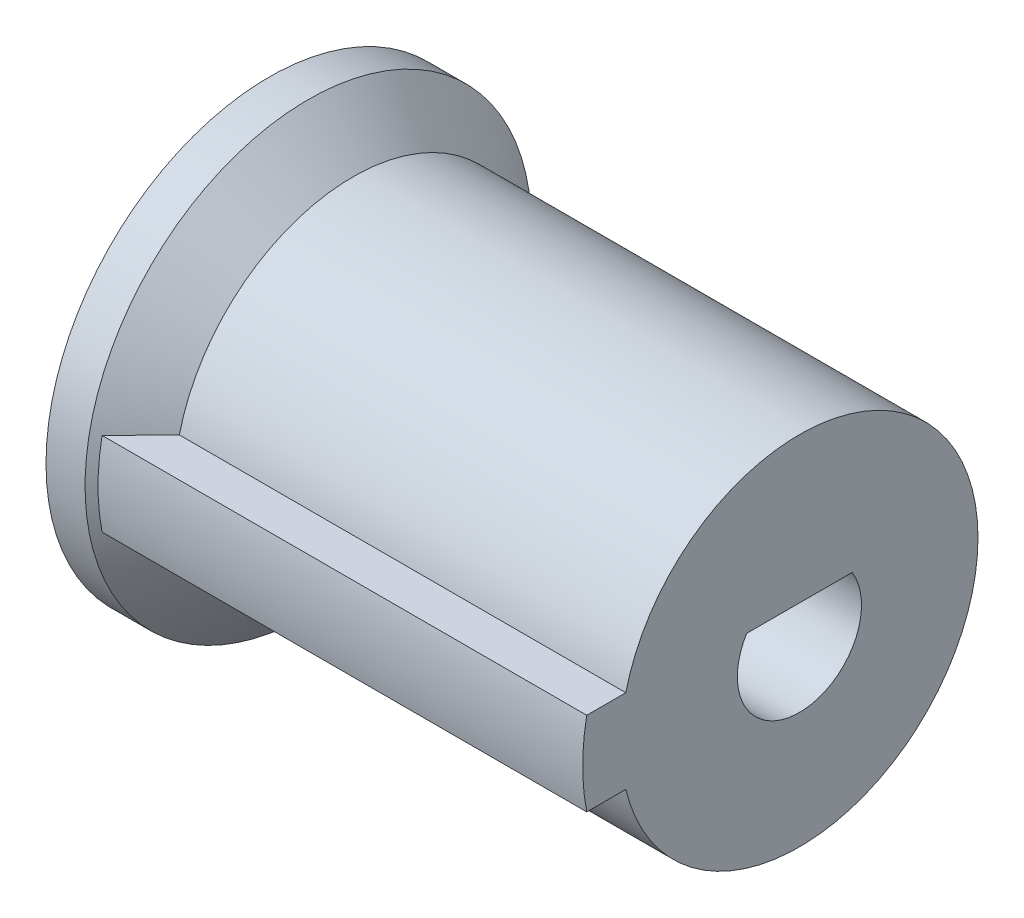
ISO-10303-21;
HEADER;
FILE_DESCRIPTION(('STEP AP214'),'2;1');
FILE_NAME('part.step','',(''),(''),'','','');
FILE_SCHEMA(('AUTOMOTIVE_DESIGN { 1 0 10303 214 1 1 1 1 }'));
ENDSEC;
DATA;
#1=APPLICATION_CONTEXT('core data for automotive mechanical design processes');
#2=APPLICATION_PROTOCOL_DEFINITION('international standard','automotive_design',2000,#1);
#3=PRODUCT_CONTEXT('',#1,'mechanical');
#4=PRODUCT('Part','Part','',(#3));
#5=PRODUCT_RELATED_PRODUCT_CATEGORY('part','',(#4));
#6=PRODUCT_DEFINITION_FORMATION('','',#4);
#7=PRODUCT_DEFINITION_CONTEXT('part definition',#1,'design');
#8=PRODUCT_DEFINITION('design','',#6,#7);
#9=PRODUCT_DEFINITION_SHAPE('','',#8);
#10=(LENGTH_UNIT() NAMED_UNIT(*) SI_UNIT(.MILLI.,.METRE.));
#11=(NAMED_UNIT(*) PLANE_ANGLE_UNIT() SI_UNIT($,.RADIAN.));
#12=(NAMED_UNIT(*) SI_UNIT($,.STERADIAN.) SOLID_ANGLE_UNIT());
#13=UNCERTAINTY_MEASURE_WITH_UNIT(LENGTH_MEASURE(1.E-05),#10,'distance_accuracy_value','');
#14=(GEOMETRIC_REPRESENTATION_CONTEXT(3) GLOBAL_UNCERTAINTY_ASSIGNED_CONTEXT((#13)) GLOBAL_UNIT_ASSIGNED_CONTEXT((#10,
#11,#12)) REPRESENTATION_CONTEXT('',''));
#15=CARTESIAN_POINT('',(0.,0.,0.));
#16=DIRECTION('',(0.,0.,1.));
#17=DIRECTION('',(1.,0.,0.));
#18=AXIS2_PLACEMENT_3D('',#15,#16,#17);
#19=CARTESIAN_POINT('',(16.,0.,0.));
#20=DIRECTION('',(-1.,0.,0.));
#21=DIRECTION('',(0.,0.,1.));
#22=AXIS2_PLACEMENT_3D('',#19,#20,#21);
#23=CYLINDRICAL_SURFACE('',#22,2.225);
#24=DIRECTION('',(-1.,0.,0.));
#25=VECTOR('',#24,1.);
#26=CARTESIAN_POINT('',(16.,1.175,-1.88944436276912));
#27=LINE('',#26,#25);
#28=CARTESIAN_POINT('',(16.,1.175,-1.88944436276912));
#29=VERTEX_POINT('',#28);
#30=CARTESIAN_POINT('',(-3.,1.175,-1.88944436276912));
#31=VERTEX_POINT('',#30);
#32=EDGE_CURVE('E106',#29,#31,#27,.T.);
#33=ORIENTED_EDGE('',*,*,#32,.T.);
#34=CARTESIAN_POINT('',(-3.,0.,0.));
#35=DIRECTION('',(1.,0.,0.));
#36=DIRECTION('',(0.,0.,-1.));
#37=AXIS2_PLACEMENT_3D('',#34,#35,#36);
#38=CIRCLE('',#37,2.225);
#39=CARTESIAN_POINT('',(-3.,1.175,1.88944436276912));
#40=VERTEX_POINT('',#39);
#41=EDGE_CURVE('E109',#40,#31,#38,.T.);
#42=ORIENTED_EDGE('',*,*,#41,.F.);
#43=DIRECTION('',(-1.,0.,0.));
#44=VECTOR('',#43,1.);
#45=CARTESIAN_POINT('',(16.,1.175,1.88944436276912));
#46=LINE('',#45,#44);
#47=CARTESIAN_POINT('',(16.,1.175,1.88944436276912));
#48=VERTEX_POINT('',#47);
#49=EDGE_CURVE('E95',#48,#40,#46,.T.);
#50=ORIENTED_EDGE('',*,*,#49,.F.);
#51=CARTESIAN_POINT('',(16.,0.,0.));
#52=DIRECTION('',(1.,0.,0.));
#53=DIRECTION('',(0.,0.,-1.));
#54=AXIS2_PLACEMENT_3D('',#51,#52,#53);
#55=CIRCLE('',#54,2.225);
#56=EDGE_CURVE('E129',#48,#29,#55,.T.);
#57=ORIENTED_EDGE('',*,*,#56,.T.);
#58=EDGE_LOOP('',(#33,#42,#50,#57));
#59=FACE_BOUND('',#58,.T.);
#60=ADVANCED_FACE('F36',(#59),#23,.F.);
#61=CARTESIAN_POINT('',(16.,1.5,0.));
#62=DIRECTION('',(0.,-1.,0.));
#63=DIRECTION('',(0.,0.,-1.));
#64=AXIS2_PLACEMENT_3D('',#61,#62,#63);
#65=PLANE('',#64);
#66=DIRECTION('',(-1.,0.,0.));
#67=VECTOR('',#66,1.);
#68=CARTESIAN_POINT('',(16.,1.5,6.22173609212091));
#69=LINE('',#68,#67);
#70=CARTESIAN_POINT('',(16.,1.5,6.22173609212091));
#71=VERTEX_POINT('',#70);
#72=CARTESIAN_POINT('',(0.,1.5,6.22173609212091));
#73=VERTEX_POINT('',#72);
#74=EDGE_CURVE('E131',#71,#73,#69,.T.);
#75=ORIENTED_EDGE('',*,*,#74,.T.);
#76=CARTESIAN_POINT('',(0.,1.5,6.22173609212088));
#77=CARTESIAN_POINT('',(-0.113699242355352,1.5,6.33869128195683));
#78=CARTESIAN_POINT('',(-0.227487223270543,1.5,6.45556013833574));
#79=CARTESIAN_POINT('',(-0.455217540474995,1.5,6.68914707584345));
#80=CARTESIAN_POINT('',(-0.569159876560946,1.5,6.80586515717044));
#81=CARTESIAN_POINT('',(-0.79717604183207,1.5,7.03917270311552));
#82=CARTESIAN_POINT('',(-0.911249870971236,1.5,7.15576216777858));
#83=CARTESIAN_POINT('',(-1.13951221595605,1.5,7.38882907992006));
#84=CARTESIAN_POINT('',(-1.25370073195215,1.5,7.50530652725115));
#85=CARTESIAN_POINT('',(-1.3679380184151,1.5,7.62173609212091));
#86=B_SPLINE_CURVE_WITH_KNOTS('',3,(#76,#77,#78,#79,#80,#81,#82,#83,#84,#85),.UNSPECIFIED.,.F.,
.F.,(4,2,2,2,4),(0.,0.489340572039448,0.978680500166129,1.46802025712641,1.95736065684443),.UNSPECIFIED.);
#87=CARTESIAN_POINT('',(-1.36793801841511,1.5,7.62173609212091));
#88=VERTEX_POINT('',#87);
#89=EDGE_CURVE('E143',#73,#88,#86,.T.);
#90=ORIENTED_EDGE('',*,*,#89,.T.);
#91=DIRECTION('',(-1.,0.,0.));
#92=VECTOR('',#91,1.);
#93=CARTESIAN_POINT('',(16.,1.5,7.62173609212091));
#94=LINE('',#93,#92);
#95=CARTESIAN_POINT('',(16.,1.5,7.62173609212091));
#96=VERTEX_POINT('',#95);
#97=EDGE_CURVE('E63',#96,#88,#94,.T.);
#98=ORIENTED_EDGE('',*,*,#97,.F.);
#99=DIRECTION('',(0.,0.,1.));
#100=VECTOR('',#99,1.);
#101=CARTESIAN_POINT('',(16.,1.5,0.));
#102=LINE('',#101,#100);
#103=EDGE_CURVE('E117',#71,#96,#102,.T.);
#104=ORIENTED_EDGE('',*,*,#103,.F.);
#105=EDGE_LOOP('',(#75,#90,#98,#104));
#106=FACE_BOUND('',#105,.T.);
#107=ADVANCED_FACE('F148',(#106),#65,.F.);
#108=CARTESIAN_POINT('',(16.,0.,0.));
#109=DIRECTION('',(-1.,0.,0.));
#110=DIRECTION('',(0.,0.,1.));
#111=AXIS2_PLACEMENT_3D('',#108,#109,#110);
#112=CYLINDRICAL_SURFACE('',#111,7.76793801841509);
#113=ORIENTED_EDGE('',*,*,#97,.T.);
#114=CARTESIAN_POINT('',(-1.3679380184151,0.,0.));
#115=DIRECTION('',(-1.,0.,0.));
#116=DIRECTION('',(0.,0.,1.));
#117=AXIS2_PLACEMENT_3D('',#114,#115,#116);
#118=CIRCLE('',#117,7.76793801841509);
#119=CARTESIAN_POINT('',(-1.36793801841511,-1.5,7.62173609212091));
#120=VERTEX_POINT('',#119);
#121=EDGE_CURVE('E50',#88,#120,#118,.F.);
#122=ORIENTED_EDGE('',*,*,#121,.T.);
#123=DIRECTION('',(-1.,0.,0.));
#124=VECTOR('',#123,1.);
#125=CARTESIAN_POINT('',(16.,-1.5,7.62173609212091));
#126=LINE('',#125,#124);
#127=CARTESIAN_POINT('',(16.,-1.5,7.62173609212091));
#128=VERTEX_POINT('',#127);
#129=EDGE_CURVE('E56',#128,#120,#126,.T.);
#130=ORIENTED_EDGE('',*,*,#129,.F.);
#131=CARTESIAN_POINT('',(16.,0.,0.));
#132=DIRECTION('',(1.,0.,0.));
#133=DIRECTION('',(0.,0.,-1.));
#134=AXIS2_PLACEMENT_3D('',#131,#132,#133);
#135=CIRCLE('',#134,7.76793801841509);
#136=EDGE_CURVE('E123',#96,#128,#135,.T.);
#137=ORIENTED_EDGE('',*,*,#136,.F.);
#138=EDGE_LOOP('',(#113,#122,#130,#137));
#139=FACE_BOUND('',#138,.T.);
#140=ADVANCED_FACE('F152',(#139),#112,.T.);
#141=CARTESIAN_POINT('',(16.,-1.5,0.));
#142=DIRECTION('',(0.,-1.,0.));
#143=DIRECTION('',(0.,0.,-1.));
#144=AXIS2_PLACEMENT_3D('',#141,#142,#143);
#145=PLANE('',#144);
#146=ORIENTED_EDGE('',*,*,#129,.T.);
#147=CARTESIAN_POINT('',(-1.3679380184151,-1.5,7.62173609212091));
#148=CARTESIAN_POINT('',(-1.25370073195215,-1.5,7.50530652725115));
#149=CARTESIAN_POINT('',(-1.13951221595605,-1.5,7.38882907992006));
#150=CARTESIAN_POINT('',(-0.911249870971236,-1.5,7.15576216777858));
#151=CARTESIAN_POINT('',(-0.797176041832071,-1.5,7.03917270311552));
#152=CARTESIAN_POINT('',(-0.569159876560947,-1.5,6.80586515717044));
#153=CARTESIAN_POINT('',(-0.455217540474996,-1.5,6.68914707584345));
#154=CARTESIAN_POINT('',(-0.227487223270544,-1.5,6.45556013833574));
#155=CARTESIAN_POINT('',(-0.113699242355352,-1.5,6.33869128195683));
#156=CARTESIAN_POINT('',(0.,-1.5,6.22173609212088));
#157=B_SPLINE_CURVE_WITH_KNOTS('',3,(#147,#148,#149,#150,#151,#152,#153,#154,#155,#156),
.UNSPECIFIED.,.F.,.F.,(4,2,2,2,4),(0.,0.489340399718017,0.978680156678296,1.46802008480498,
1.95736065684443),.UNSPECIFIED.);
#158=CARTESIAN_POINT('',(0.,-1.5,6.22173609212091));
#159=VERTEX_POINT('',#158);
#160=EDGE_CURVE('E11',#120,#159,#157,.T.);
#161=ORIENTED_EDGE('',*,*,#160,.T.);
#162=DIRECTION('',(-1.,0.,0.));
#163=VECTOR('',#162,1.);
#164=CARTESIAN_POINT('',(16.,-1.5,6.22173609212091));
#165=LINE('',#164,#163);
#166=CARTESIAN_POINT('',(16.,-1.5,6.22173609212091));
#167=VERTEX_POINT('',#166);
#168=EDGE_CURVE('E136',#167,#159,#165,.T.);
#169=ORIENTED_EDGE('',*,*,#168,.F.);
#170=DIRECTION('',(0.,0.,1.));
#171=VECTOR('',#170,1.);
#172=CARTESIAN_POINT('',(16.,-1.5,0.));
#173=LINE('',#172,#171);
#174=EDGE_CURVE('E125',#167,#128,#173,.T.);
#175=ORIENTED_EDGE('',*,*,#174,.T.);
#176=EDGE_LOOP('',(#146,#161,#169,#175));
#177=FACE_BOUND('',#176,.T.);
#178=ADVANCED_FACE('F155',(#177),#145,.T.);
#179=CARTESIAN_POINT('',(16.,0.,0.));
#180=DIRECTION('',(-1.,0.,0.));
#181=DIRECTION('',(0.,0.,1.));
#182=AXIS2_PLACEMENT_3D('',#179,#180,#181);
#183=CYLINDRICAL_SURFACE('',#182,6.4);
#184=CARTESIAN_POINT('',(0.,0.,0.));
#185=DIRECTION('',(1.,0.,0.));
#186=DIRECTION('',(0.,0.,-1.));
#187=AXIS2_PLACEMENT_3D('',#184,#185,#186);
#188=CIRCLE('',#187,6.4);
#189=EDGE_CURVE('E114',#159,#73,#188,.T.);
#190=ORIENTED_EDGE('',*,*,#189,.T.);
#191=ORIENTED_EDGE('',*,*,#74,.F.);
#192=CARTESIAN_POINT('',(16.,0.,0.));
#193=DIRECTION('',(1.,0.,0.));
#194=DIRECTION('',(0.,0.,-1.));
#195=AXIS2_PLACEMENT_3D('',#192,#193,#194);
#196=CIRCLE('',#195,6.4);
#197=EDGE_CURVE('E127',#167,#71,#196,.T.);
#198=ORIENTED_EDGE('',*,*,#197,.F.);
#199=ORIENTED_EDGE('',*,*,#168,.T.);
#200=EDGE_LOOP('',(#190,#191,#198,#199));
#201=FACE_BOUND('',#200,.T.);
#202=ADVANCED_FACE('F159',(#201),#183,.T.);
#203=CARTESIAN_POINT('',(16.,1.175,0.));
#204=DIRECTION('',(0.,1.,0.));
#205=DIRECTION('',(0.,0.,1.));
#206=AXIS2_PLACEMENT_3D('',#203,#204,#205);
#207=PLANE('',#206);
#208=ORIENTED_EDGE('',*,*,#49,.T.);
#209=DIRECTION('',(0.,0.,-1.));
#210=VECTOR('',#209,1.);
#211=CARTESIAN_POINT('',(-3.,1.175,0.));
#212=LINE('',#211,#210);
#213=EDGE_CURVE('E100',#40,#31,#212,.T.);
#214=ORIENTED_EDGE('',*,*,#213,.T.);
#215=ORIENTED_EDGE('',*,*,#32,.F.);
#216=DIRECTION('',(0.,0.,-1.));
#217=VECTOR('',#216,1.);
#218=CARTESIAN_POINT('',(16.,1.175,0.));
#219=LINE('',#218,#217);
#220=EDGE_CURVE('E101',#48,#29,#219,.T.);
#221=ORIENTED_EDGE('',*,*,#220,.F.);
#222=EDGE_LOOP('',(#208,#214,#215,#221));
#223=FACE_BOUND('',#222,.T.);
#224=ADVANCED_FACE('F97',(#223),#207,.F.);
#225=CARTESIAN_POINT('',(16.,0.,0.));
#226=DIRECTION('',(1.,0.,0.));
#227=DIRECTION('',(0.,0.,-1.));
#228=AXIS2_PLACEMENT_3D('',#225,#226,#227);
#229=PLANE('',#228);
#230=ORIENTED_EDGE('',*,*,#103,.T.);
#231=ORIENTED_EDGE('',*,*,#136,.T.);
#232=ORIENTED_EDGE('',*,*,#174,.F.);
#233=ORIENTED_EDGE('',*,*,#197,.T.);
#234=EDGE_LOOP('',(#230,#231,#232,#233));
#235=FACE_BOUND('',#234,.T.);
#236=ORIENTED_EDGE('',*,*,#56,.F.);
#237=ORIENTED_EDGE('',*,*,#220,.T.);
#238=EDGE_LOOP('',(#236,#237));
#239=FACE_BOUND('',#238,.T.);
#240=ADVANCED_FACE('F167',(#235,#239),#229,.T.);
#241=CARTESIAN_POINT('',(-3.,0.,0.));
#242=DIRECTION('',(1.,0.,0.));
#243=DIRECTION('',(0.,0.,-1.));
#244=AXIS2_PLACEMENT_3D('',#241,#242,#243);
#245=CYLINDRICAL_SURFACE('',#244,8.);
#246=CARTESIAN_POINT('',(-1.60000000000001,0.,0.));
#247=DIRECTION('',(1.,0.,0.));
#248=DIRECTION('',(0.,0.,-1.));
#249=AXIS2_PLACEMENT_3D('',#246,#247,#248);
#250=CIRCLE('',#249,8.);
#251=CARTESIAN_POINT('',(-1.60000000000001,0.,-8.));
#252=VERTEX_POINT('',#251);
#253=EDGE_CURVE('E105',#252,#252,#250,.F.);
#254=ORIENTED_EDGE('',*,*,#253,.T.);
#255=EDGE_LOOP('',(#254));
#256=FACE_BOUND('',#255,.T.);
#257=CARTESIAN_POINT('',(-3.,0.,0.));
#258=DIRECTION('',(1.,0.,0.));
#259=DIRECTION('',(0.,0.,-1.));
#260=AXIS2_PLACEMENT_3D('',#257,#258,#259);
#261=CIRCLE('',#260,8.);
#262=CARTESIAN_POINT('',(-3.,0.,-8.));
#263=VERTEX_POINT('',#262);
#264=EDGE_CURVE('E111',#263,#263,#261,.T.);
#265=ORIENTED_EDGE('',*,*,#264,.T.);
#266=EDGE_LOOP('',(#265));
#267=FACE_BOUND('',#266,.T.);
#268=ADVANCED_FACE('F170',(#256,#267),#245,.T.);
#269=CARTESIAN_POINT('',(-3.,0.,0.));
#270=DIRECTION('',(1.,0.,0.));
#271=DIRECTION('',(0.,0.,-1.));
#272=AXIS2_PLACEMENT_3D('',#269,#270,#271);
#273=PLANE('',#272);
#274=ORIENTED_EDGE('',*,*,#264,.F.);
#275=EDGE_LOOP('',(#274));
#276=FACE_BOUND('',#275,.T.);
#277=ORIENTED_EDGE('',*,*,#41,.T.);
#278=ORIENTED_EDGE('',*,*,#213,.F.);
#279=EDGE_LOOP('',(#277,#278));
#280=FACE_BOUND('',#279,.T.);
#281=ADVANCED_FACE('F113',(#276,#280),#273,.F.);
#282=CARTESIAN_POINT('',(0.,0.,0.));
#283=DIRECTION('',(-1.,0.,0.));
#284=DIRECTION('',(0.,0.,1.));
#285=AXIS2_PLACEMENT_3D('',#282,#283,#284);
#286=CONICAL_SURFACE('',#285,6.39999999999997,0.785398163397454);
#287=ORIENTED_EDGE('',*,*,#253,.F.);
#288=EDGE_LOOP('',(#287));
#289=FACE_BOUND('',#288,.T.);
#290=ORIENTED_EDGE('',*,*,#89,.F.);
#291=ORIENTED_EDGE('',*,*,#189,.F.);
#292=ORIENTED_EDGE('',*,*,#160,.F.);
#293=ORIENTED_EDGE('',*,*,#121,.F.);
#294=EDGE_LOOP('',(#290,#291,#292,#293));
#295=FACE_BOUND('',#294,.T.);
#296=ADVANCED_FACE('F38',(#289,#295),#286,.T.);
#297=CLOSED_SHELL('',(#60,#107,#140,#178,#202,#224,#240,#268,#281,#296));
#298=MANIFOLD_SOLID_BREP('B2',#297);
#299=ADVANCED_BREP_SHAPE_REPRESENTATION('',(#18,#298),#14);
#300=SHAPE_DEFINITION_REPRESENTATION(#9,#299);
ENDSEC;
END-ISO-10303-21;
